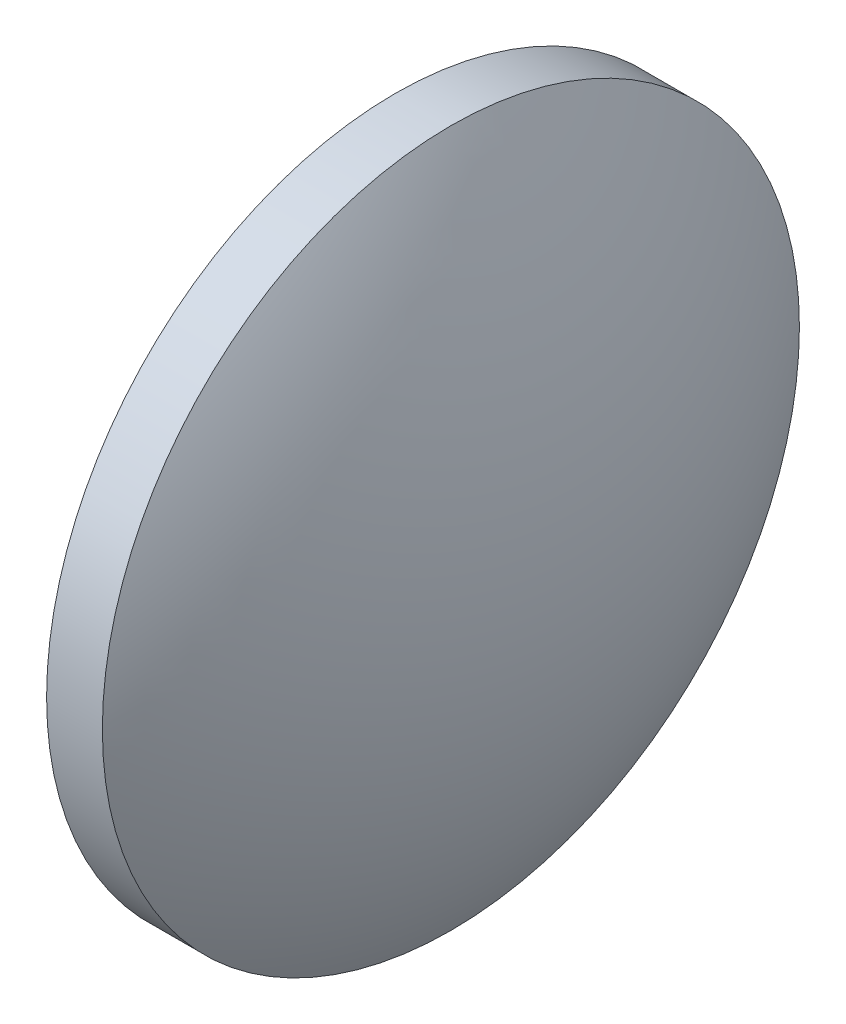
ISO-10303-21;
HEADER;
FILE_DESCRIPTION(('STEP AP214'),'2;1');
FILE_NAME('part.step','',(''),(''),'','','');
FILE_SCHEMA(('AUTOMOTIVE_DESIGN { 1 0 10303 214 1 1 1 1 }'));
ENDSEC;
DATA;
#1=APPLICATION_CONTEXT('core data for automotive mechanical design processes');
#2=APPLICATION_PROTOCOL_DEFINITION('international standard','automotive_design',2000,#1);
#3=PRODUCT_CONTEXT('',#1,'mechanical');
#4=PRODUCT('Part','Part','',(#3));
#5=PRODUCT_RELATED_PRODUCT_CATEGORY('part','',(#4));
#6=PRODUCT_DEFINITION_FORMATION('','',#4);
#7=PRODUCT_DEFINITION_CONTEXT('part definition',#1,'design');
#8=PRODUCT_DEFINITION('design','',#6,#7);
#9=PRODUCT_DEFINITION_SHAPE('','',#8);
#10=(LENGTH_UNIT() NAMED_UNIT(*) SI_UNIT(.MILLI.,.METRE.));
#11=(NAMED_UNIT(*) PLANE_ANGLE_UNIT() SI_UNIT($,.RADIAN.));
#12=(NAMED_UNIT(*) SI_UNIT($,.STERADIAN.) SOLID_ANGLE_UNIT());
#13=UNCERTAINTY_MEASURE_WITH_UNIT(LENGTH_MEASURE(1.E-05),#10,'distance_accuracy_value','');
#14=(GEOMETRIC_REPRESENTATION_CONTEXT(3) GLOBAL_UNCERTAINTY_ASSIGNED_CONTEXT((#13)) GLOBAL_UNIT_ASSIGNED_CONTEXT((#10,
#11,#12)) REPRESENTATION_CONTEXT('',''));
#15=CARTESIAN_POINT('',(0.,0.,0.));
#16=DIRECTION('',(0.,0.,1.));
#17=DIRECTION('',(1.,0.,0.));
#18=AXIS2_PLACEMENT_3D('',#15,#16,#17);
#19=CARTESIAN_POINT('',(104.806360059684,47.8505049440793,0.));
#20=DIRECTION('',(-1.,0.,0.));
#21=DIRECTION('',(0.,1.,0.));
#22=AXIS2_PLACEMENT_3D('',#19,#20,#21);
#23=SPHERICAL_SURFACE('',#22,24.1897126436781);
#24=CARTESIAN_POINT('',(84.0966474160061,47.8505049440793,0.));
#25=DIRECTION('',(-1.,0.,0.));
#26=DIRECTION('',(0.,-1.,0.));
#27=AXIS2_PLACEMENT_3D('',#24,#25,#26);
#28=CIRCLE('',#27,12.5);
#29=CARTESIAN_POINT('',(84.0966474160061,35.3505049440793,0.));
#30=VERTEX_POINT('',#29);
#31=EDGE_CURVE('E41',#30,#30,#28,.T.);
#32=ORIENTED_EDGE('',*,*,#31,.T.);
#33=EDGE_LOOP('',(#32));
#34=FACE_BOUND('',#33,.T.);
#35=ADVANCED_FACE('F35',(#34),#23,.T.);
#36=CARTESIAN_POINT('',(65.3869347723279,47.8505049440793,0.));
#37=DIRECTION('',(-1.,0.,0.));
#38=DIRECTION('',(0.,1.,0.));
#39=AXIS2_PLACEMENT_3D('',#36,#37,#38);
#40=SPHERICAL_SURFACE('',#39,24.1897126436781);
#41=CARTESIAN_POINT('',(86.0966474160061,47.8505049440793,0.));
#42=DIRECTION('',(-1.,0.,0.));
#43=DIRECTION('',(0.,-1.,0.));
#44=AXIS2_PLACEMENT_3D('',#41,#42,#43);
#45=CIRCLE('',#44,12.5);
#46=CARTESIAN_POINT('',(86.0966474160061,35.3505049440793,0.));
#47=VERTEX_POINT('',#46);
#48=EDGE_CURVE('E10',#47,#47,#45,.T.);
#49=ORIENTED_EDGE('',*,*,#48,.F.);
#50=EDGE_LOOP('',(#49));
#51=FACE_BOUND('',#50,.T.);
#52=ADVANCED_FACE('F50',(#51),#40,.T.);
#53=CARTESIAN_POINT('',(76.6262128614906,47.8505049440793,0.));
#54=DIRECTION('',(-1.,0.,0.));
#55=DIRECTION('',(0.,-1.,0.));
#56=AXIS2_PLACEMENT_3D('',#53,#54,#55);
#57=CYLINDRICAL_SURFACE('',#56,12.5);
#58=ORIENTED_EDGE('',*,*,#48,.T.);
#59=EDGE_LOOP('',(#58));
#60=FACE_BOUND('',#59,.T.);
#61=ORIENTED_EDGE('',*,*,#31,.F.);
#62=EDGE_LOOP('',(#61));
#63=FACE_BOUND('',#62,.T.);
#64=ADVANCED_FACE('F48',(#60,#63),#57,.T.);
#65=CLOSED_SHELL('',(#35,#52,#64));
#66=MANIFOLD_SOLID_BREP('B2',#65);
#67=ADVANCED_BREP_SHAPE_REPRESENTATION('',(#18,#66),#14);
#68=SHAPE_DEFINITION_REPRESENTATION(#9,#67);
ENDSEC;
END-ISO-10303-21;
